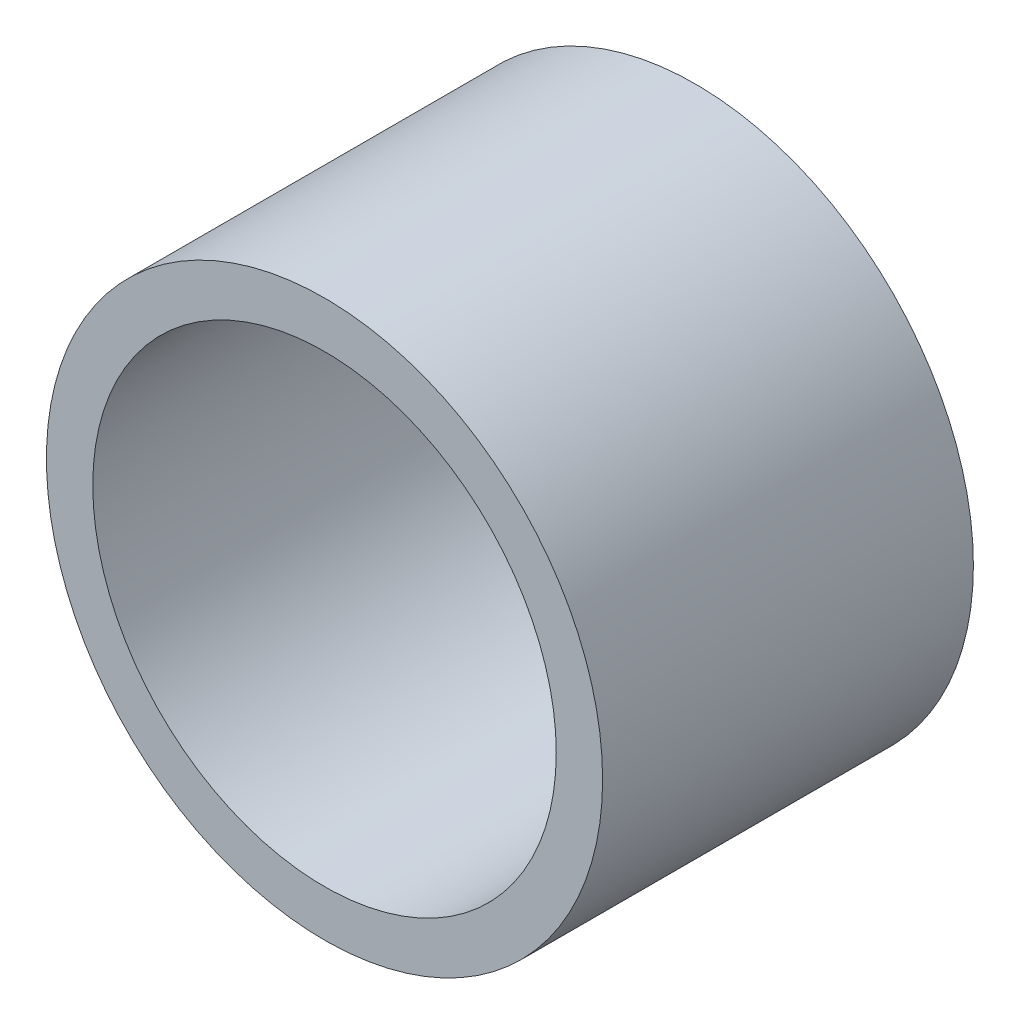
ISO-10303-21;
HEADER;
FILE_DESCRIPTION(('STEP AP214'),'2;1');
FILE_NAME('part.step','',(''),(''),'','','');
FILE_SCHEMA(('AUTOMOTIVE_DESIGN { 1 0 10303 214 1 1 1 1 }'));
ENDSEC;
DATA;
#1=APPLICATION_CONTEXT('core data for automotive mechanical design processes');
#2=APPLICATION_PROTOCOL_DEFINITION('international standard','automotive_design',2000,#1);
#3=PRODUCT_CONTEXT('',#1,'mechanical');
#4=PRODUCT('Part','Part','',(#3));
#5=PRODUCT_RELATED_PRODUCT_CATEGORY('part','',(#4));
#6=PRODUCT_DEFINITION_FORMATION('','',#4);
#7=PRODUCT_DEFINITION_CONTEXT('part definition',#1,'design');
#8=PRODUCT_DEFINITION('design','',#6,#7);
#9=PRODUCT_DEFINITION_SHAPE('','',#8);
#10=(LENGTH_UNIT() NAMED_UNIT(*) SI_UNIT(.MILLI.,.METRE.));
#11=(NAMED_UNIT(*) PLANE_ANGLE_UNIT() SI_UNIT($,.RADIAN.));
#12=(NAMED_UNIT(*) SI_UNIT($,.STERADIAN.) SOLID_ANGLE_UNIT());
#13=UNCERTAINTY_MEASURE_WITH_UNIT(LENGTH_MEASURE(1.E-05),#10,'distance_accuracy_value','');
#14=(GEOMETRIC_REPRESENTATION_CONTEXT(3) GLOBAL_UNCERTAINTY_ASSIGNED_CONTEXT((#13)) GLOBAL_UNIT_ASSIGNED_CONTEXT((#10,
#11,#12)) REPRESENTATION_CONTEXT('',''));
#15=CARTESIAN_POINT('',(0.,0.,0.));
#16=DIRECTION('',(0.,0.,1.));
#17=DIRECTION('',(1.,0.,0.));
#18=AXIS2_PLACEMENT_3D('',#15,#16,#17);
#19=CARTESIAN_POINT('',(0.,0.,25.4));
#20=DIRECTION('',(0.,0.,1.));
#21=DIRECTION('',(1.,0.,0.));
#22=AXIS2_PLACEMENT_3D('',#19,#20,#21);
#23=PLANE('',#22);
#24=CARTESIAN_POINT('',(0.,0.,25.4));
#25=DIRECTION('',(0.,0.,1.));
#26=DIRECTION('',(1.,0.,0.));
#27=AXIS2_PLACEMENT_3D('',#24,#25,#26);
#28=CIRCLE('',#27,19.05);
#29=CARTESIAN_POINT('',(19.05,0.,25.4));
#30=VERTEX_POINT('',#29);
#31=EDGE_CURVE('E10',#30,#30,#28,.T.);
#32=ORIENTED_EDGE('',*,*,#31,.T.);
#33=EDGE_LOOP('',(#32));
#34=FACE_BOUND('',#33,.T.);
#35=CARTESIAN_POINT('',(0.,0.,25.4));
#36=DIRECTION('',(0.,0.,1.));
#37=DIRECTION('',(1.,0.,0.));
#38=AXIS2_PLACEMENT_3D('',#35,#36,#37);
#39=CIRCLE('',#38,15.875);
#40=CARTESIAN_POINT('',(15.875,0.,25.4));
#41=VERTEX_POINT('',#40);
#42=EDGE_CURVE('E44',#41,#41,#39,.T.);
#43=ORIENTED_EDGE('',*,*,#42,.F.);
#44=EDGE_LOOP('',(#43));
#45=FACE_BOUND('',#44,.T.);
#46=ADVANCED_FACE('F33',(#34,#45),#23,.T.);
#47=CARTESIAN_POINT('',(0.,0.,0.));
#48=DIRECTION('',(0.,0.,1.));
#49=DIRECTION('',(1.,0.,0.));
#50=AXIS2_PLACEMENT_3D('',#47,#48,#49);
#51=PLANE('',#50);
#52=CARTESIAN_POINT('',(0.,0.,0.));
#53=DIRECTION('',(0.,0.,1.));
#54=DIRECTION('',(1.,0.,0.));
#55=AXIS2_PLACEMENT_3D('',#52,#53,#54);
#56=CIRCLE('',#55,19.05);
#57=CARTESIAN_POINT('',(19.05,0.,0.));
#58=VERTEX_POINT('',#57);
#59=EDGE_CURVE('E37',#58,#58,#56,.T.);
#60=ORIENTED_EDGE('',*,*,#59,.F.);
#61=EDGE_LOOP('',(#60));
#62=FACE_BOUND('',#61,.T.);
#63=CARTESIAN_POINT('',(0.,0.,0.));
#64=DIRECTION('',(0.,0.,1.));
#65=DIRECTION('',(1.,0.,0.));
#66=AXIS2_PLACEMENT_3D('',#63,#64,#65);
#67=CIRCLE('',#66,15.875);
#68=CARTESIAN_POINT('',(15.875,0.,0.));
#69=VERTEX_POINT('',#68);
#70=EDGE_CURVE('E46',#69,#69,#67,.T.);
#71=ORIENTED_EDGE('',*,*,#70,.T.);
#72=EDGE_LOOP('',(#71));
#73=FACE_BOUND('',#72,.T.);
#74=ADVANCED_FACE('F56',(#62,#73),#51,.F.);
#75=CARTESIAN_POINT('',(0.,0.,25.4));
#76=DIRECTION('',(0.,0.,-1.));
#77=DIRECTION('',(-1.,0.,0.));
#78=AXIS2_PLACEMENT_3D('',#75,#76,#77);
#79=CYLINDRICAL_SURFACE('',#78,19.05);
#80=ORIENTED_EDGE('',*,*,#31,.F.);
#81=EDGE_LOOP('',(#80));
#82=FACE_BOUND('',#81,.T.);
#83=ORIENTED_EDGE('',*,*,#59,.T.);
#84=EDGE_LOOP('',(#83));
#85=FACE_BOUND('',#84,.T.);
#86=ADVANCED_FACE('F35',(#82,#85),#79,.T.);
#87=CARTESIAN_POINT('',(0.,0.,25.4));
#88=DIRECTION('',(0.,0.,-1.));
#89=DIRECTION('',(-1.,0.,0.));
#90=AXIS2_PLACEMENT_3D('',#87,#88,#89);
#91=CYLINDRICAL_SURFACE('',#90,15.875);
#92=ORIENTED_EDGE('',*,*,#42,.T.);
#93=EDGE_LOOP('',(#92));
#94=FACE_BOUND('',#93,.T.);
#95=ORIENTED_EDGE('',*,*,#70,.F.);
#96=EDGE_LOOP('',(#95));
#97=FACE_BOUND('',#96,.T.);
#98=ADVANCED_FACE('F52',(#94,#97),#91,.F.);
#99=CLOSED_SHELL('',(#46,#74,#86,#98));
#100=MANIFOLD_SOLID_BREP('B2',#99);
#101=ADVANCED_BREP_SHAPE_REPRESENTATION('',(#18,#100),#14);
#102=SHAPE_DEFINITION_REPRESENTATION(#9,#101);
ENDSEC;
END-ISO-10303-21;
